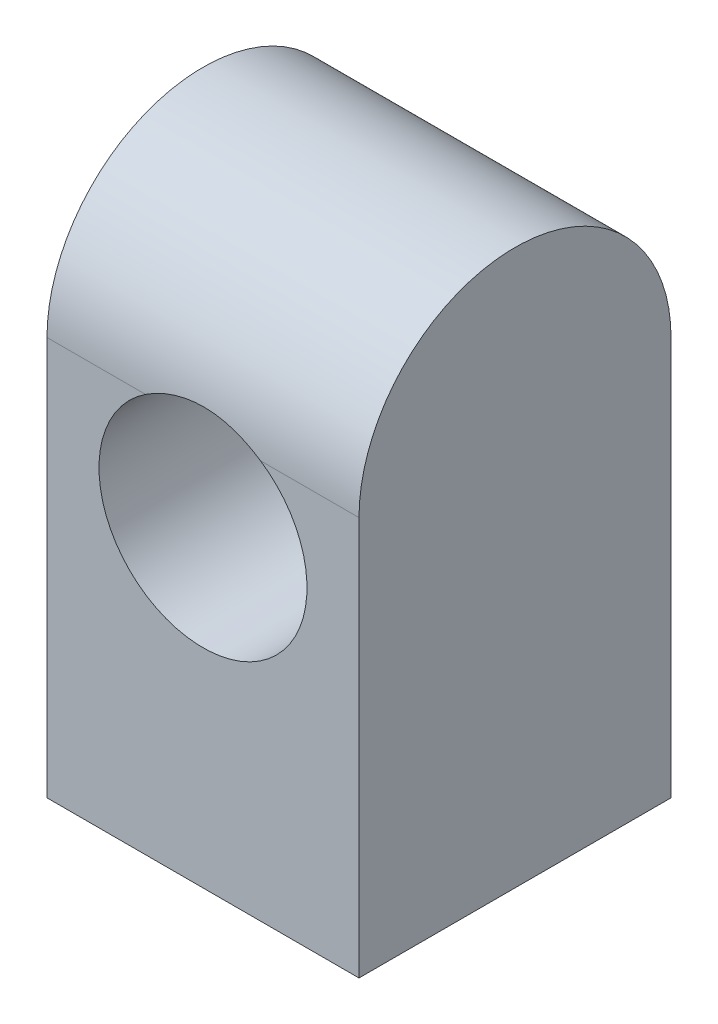
ISO-10303-21;
HEADER;
FILE_DESCRIPTION(('STEP AP214'),'2;1');
FILE_NAME('part.step','',(''),(''),'','','');
FILE_SCHEMA(('AUTOMOTIVE_DESIGN { 1 0 10303 214 1 1 1 1 }'));
ENDSEC;
DATA;
#1=APPLICATION_CONTEXT('core data for automotive mechanical design processes');
#2=APPLICATION_PROTOCOL_DEFINITION('international standard','automotive_design',2000,#1);
#3=PRODUCT_CONTEXT('',#1,'mechanical');
#4=PRODUCT('Part','Part','',(#3));
#5=PRODUCT_RELATED_PRODUCT_CATEGORY('part','',(#4));
#6=PRODUCT_DEFINITION_FORMATION('','',#4);
#7=PRODUCT_DEFINITION_CONTEXT('part definition',#1,'design');
#8=PRODUCT_DEFINITION('design','',#6,#7);
#9=PRODUCT_DEFINITION_SHAPE('','',#8);
#10=(LENGTH_UNIT() NAMED_UNIT(*) SI_UNIT(.MILLI.,.METRE.));
#11=(NAMED_UNIT(*) PLANE_ANGLE_UNIT() SI_UNIT($,.RADIAN.));
#12=(NAMED_UNIT(*) SI_UNIT($,.STERADIAN.) SOLID_ANGLE_UNIT());
#13=UNCERTAINTY_MEASURE_WITH_UNIT(LENGTH_MEASURE(1.E-05),#10,'distance_accuracy_value','');
#14=(GEOMETRIC_REPRESENTATION_CONTEXT(3) GLOBAL_UNCERTAINTY_ASSIGNED_CONTEXT((#13)) GLOBAL_UNIT_ASSIGNED_CONTEXT((#10,
#11,#12)) REPRESENTATION_CONTEXT('',''));
#15=CARTESIAN_POINT('',(0.,0.,0.));
#16=DIRECTION('',(0.,0.,1.));
#17=DIRECTION('',(1.,0.,0.));
#18=AXIS2_PLACEMENT_3D('',#15,#16,#17);
#19=CARTESIAN_POINT('',(18.,17.1398997695578,-8.));
#20=DIRECTION('',(0.,0.,1.));
#21=DIRECTION('',(0.,-1.,0.));
#22=AXIS2_PLACEMENT_3D('',#19,#20,#21);
#23=PLANE('',#22);
#24=DIRECTION('',(-1.,0.,0.));
#25=VECTOR('',#24,1.);
#26=CARTESIAN_POINT('',(18.,17.1398997695578,-8.));
#27=LINE('',#26,#25);
#28=CARTESIAN_POINT('',(5.6833752096446,17.1398997695578,-8.));
#29=VERTEX_POINT('',#28);
#30=CARTESIAN_POINT('',(0.,17.1398997695578,-8.));
#31=VERTEX_POINT('',#30);
#32=EDGE_CURVE('E192',#29,#31,#27,.T.);
#33=ORIENTED_EDGE('',*,*,#32,.F.);
#34=CARTESIAN_POINT('',(9.,12.1398997695578,-8.));
#35=DIRECTION('',(0.,0.,1.));
#36=DIRECTION('',(1.,0.,0.));
#37=AXIS2_PLACEMENT_3D('',#34,#35,#36);
#38=CIRCLE('',#37,6.);
#39=CARTESIAN_POINT('',(12.3166247903554,17.1398997695578,-8.));
#40=VERTEX_POINT('',#39);
#41=EDGE_CURVE('E51',#29,#40,#38,.T.);
#42=ORIENTED_EDGE('',*,*,#41,.T.);
#43=CARTESIAN_POINT('',(18.,17.1398997695578,-8.));
#44=VERTEX_POINT('',#43);
#45=EDGE_CURVE('E45',#44,#40,#27,.T.);
#46=ORIENTED_EDGE('',*,*,#45,.F.);
#47=DIRECTION('',(0.,1.,0.));
#48=VECTOR('',#47,1.);
#49=CARTESIAN_POINT('',(18.,17.1398997695578,-8.));
#50=LINE('',#49,#48);
#51=CARTESIAN_POINT('',(18.,-5.86010023044222,-8.));
#52=VERTEX_POINT('',#51);
#53=EDGE_CURVE('E212',#52,#44,#50,.T.);
#54=ORIENTED_EDGE('',*,*,#53,.F.);
#55=DIRECTION('',(-1.,0.,0.));
#56=VECTOR('',#55,1.);
#57=CARTESIAN_POINT('',(18.,-5.86010023044222,-8.));
#58=LINE('',#57,#56);
#59=CARTESIAN_POINT('',(0.,-5.86010023044222,-8.));
#60=VERTEX_POINT('',#59);
#61=EDGE_CURVE('E207',#52,#60,#58,.T.);
#62=ORIENTED_EDGE('',*,*,#61,.T.);
#63=DIRECTION('',(0.,1.,0.));
#64=VECTOR('',#63,1.);
#65=CARTESIAN_POINT('',(0.,17.1398997695578,-8.));
#66=LINE('',#65,#64);
#67=EDGE_CURVE('E197',#60,#31,#66,.T.);
#68=ORIENTED_EDGE('',*,*,#67,.T.);
#69=EDGE_LOOP('',(#33,#42,#46,#54,#62,#68));
#70=FACE_BOUND('',#69,.T.);
#71=ADVANCED_FACE('F38',(#70),#23,.F.);
#72=CARTESIAN_POINT('',(18.,17.1398997695578,1.));
#73=DIRECTION('',(-1.,0.,0.));
#74=DIRECTION('',(0.,0.,1.));
#75=AXIS2_PLACEMENT_3D('',#72,#73,#74);
#76=CYLINDRICAL_SURFACE('',#75,9.);
#77=ORIENTED_EDGE('',*,*,#45,.T.);
#78=CARTESIAN_POINT('',(12.3166247903554,17.1398997695578,-8.));
#79=CARTESIAN_POINT('',(12.1761745481952,17.2330854943156,-7.99998280686404));
#80=CARTESIAN_POINT('',(12.0317922057003,17.3203143442929,-7.99855170663781));
#81=CARTESIAN_POINT('',(11.7362436576243,17.4823062183514,-7.99385386357663));
#82=CARTESIAN_POINT('',(11.5850782346934,17.5570706759378,-7.99058733202013));
#83=CARTESIAN_POINT('',(11.2770934608133,17.6935668618835,-7.98321231082459));
#84=CARTESIAN_POINT('',(11.1202771782546,17.7553055419582,-7.97910427260756));
#85=CARTESIAN_POINT('',(10.8020081921265,17.8653792127511,-7.97088254766373));
#86=CARTESIAN_POINT('',(10.6405554727502,17.9137141577658,-7.96676886091772));
#87=CARTESIAN_POINT('',(10.3140870773853,17.9966523238767,-7.95922487573957));
#88=CARTESIAN_POINT('',(10.1490702362471,18.0312509805381,-7.9557948046545));
#89=CARTESIAN_POINT('',(9.8166910491816,18.0864445949821,-7.9501298620152));
#90=CARTESIAN_POINT('',(9.64932872217379,18.1070396656568,-7.94789498082582));
#91=CARTESIAN_POINT('',(9.31347345902791,18.1340730104191,-7.94493181592675));
#92=CARTESIAN_POINT('',(9.14498067854111,18.1405131949243,-7.94420332890699));
#93=CARTESIAN_POINT('',(8.80805607207803,18.1391944460575,-7.94435076543655));
#94=CARTESIAN_POINT('',(8.63962424450806,18.1314359155182,-7.94522664346831));
#95=CARTESIAN_POINT('',(8.30449927814603,18.101820240337,-7.94845959650483));
#96=CARTESIAN_POINT('',(8.13780257444923,18.0800029377208,-7.95081248523223));
#97=CARTESIAN_POINT('',(7.80683097987093,18.0224641842343,-7.95666871348));
#98=CARTESIAN_POINT('',(7.64255632608802,17.9867413813878,-7.9601721648598));
#99=CARTESIAN_POINT('',(7.3176976840931,17.9016732486215,-7.96780478435024));
#100=CARTESIAN_POINT('',(7.15711147776076,17.8523363511823,-7.97193356442458));
#101=CARTESIAN_POINT('',(6.8406941967366,17.7403956363477,-7.98011947678595));
#102=CARTESIAN_POINT('',(6.68486141124776,17.6777966581074,-7.98417663462359));
#103=CARTESIAN_POINT('',(6.38435800328011,17.5421783179672,-7.99125312525322));
#104=CARTESIAN_POINT('',(6.2394875580041,17.4696031409215,-7.99430395361245));
#105=CARTESIAN_POINT('',(5.95634049468018,17.3131287467241,-7.99866854537321));
#106=CARTESIAN_POINT('',(5.81805158792701,17.2292518520194,-7.99998567918921));
#107=CARTESIAN_POINT('',(5.6833752096446,17.1398997695578,-8.));
#108=B_SPLINE_CURVE_WITH_KNOTS('',3,(#78,#79,#80,#81,#82,#83,#84,#85,#86,#87,#88,#89,#90,#91,
#92,#93,#94,#95,#96,#97,#98,#99,#100,#101,#102,#103,#104,#105,#106,#107),.UNSPECIFIED.,.F.,.F.,
(4,2,2,2,2,2,2,2,2,2,2,2,2,2,4),(0.,0.505478352133197,1.01089853003349,1.5160482845355,
2.02119976144932,2.52651895507016,3.03183407494048,3.53708099064754,4.04231357217975,
4.54612060348861,5.04997663018365,5.55352126960014,6.05688248782416,6.54253134219247,
7.02723466241762),.UNSPECIFIED.);
#109=EDGE_CURVE('E150',#40,#29,#108,.T.);
#110=ORIENTED_EDGE('',*,*,#109,.T.);
#111=ORIENTED_EDGE('',*,*,#32,.T.);
#112=CARTESIAN_POINT('',(0.,17.1398997695578,1.));
#113=DIRECTION('',(1.,0.,0.));
#114=DIRECTION('',(0.,0.,1.));
#115=AXIS2_PLACEMENT_3D('',#112,#113,#114);
#116=CIRCLE('',#115,9.);
#117=CARTESIAN_POINT('',(0.,17.1398997695578,10.));
#118=VERTEX_POINT('',#117);
#119=EDGE_CURVE('E215',#31,#118,#116,.T.);
#120=ORIENTED_EDGE('',*,*,#119,.T.);
#121=DIRECTION('',(-1.,0.,0.));
#122=VECTOR('',#121,1.);
#123=CARTESIAN_POINT('',(18.,17.1398997695578,10.));
#124=LINE('',#123,#122);
#125=CARTESIAN_POINT('',(5.6833752096446,17.1398997695578,10.));
#126=VERTEX_POINT('',#125);
#127=EDGE_CURVE('E201',#126,#118,#124,.T.);
#128=ORIENTED_EDGE('',*,*,#127,.F.);
#129=CARTESIAN_POINT('',(5.6833752096446,17.1398997695578,10.));
#130=CARTESIAN_POINT('',(5.82382545180477,17.2330854943156,9.99998280686404));
#131=CARTESIAN_POINT('',(5.96820779429973,17.3203143442929,9.99855170663781));
#132=CARTESIAN_POINT('',(6.2637563423757,17.4823062183514,9.99385386357663));
#133=CARTESIAN_POINT('',(6.41492176530659,17.5570706759378,9.99058733202013));
#134=CARTESIAN_POINT('',(6.72290653918665,17.6935668618835,9.98321231082459));
#135=CARTESIAN_POINT('',(6.87972282174541,17.7553055419582,9.97910427260756));
#136=CARTESIAN_POINT('',(7.19799180787347,17.8653792127511,9.97088254766373));
#137=CARTESIAN_POINT('',(7.35944452724977,17.9137141577658,9.96676886091772));
#138=CARTESIAN_POINT('',(7.68591292261471,17.9966523238767,9.95922487573958));
#139=CARTESIAN_POINT('',(7.85092976375287,18.0312509805381,9.9557948046545));
#140=CARTESIAN_POINT('',(8.1833089508184,18.0864445949821,9.9501298620152));
#141=CARTESIAN_POINT('',(8.3506712778262,18.1070396656568,9.94789498082582));
#142=CARTESIAN_POINT('',(8.68652654097209,18.1340730104191,9.94493181592675));
#143=CARTESIAN_POINT('',(8.85501932145889,18.1405131949243,9.94420332890699));
#144=CARTESIAN_POINT('',(9.19194392792197,18.1391944460575,9.94435076543655));
#145=CARTESIAN_POINT('',(9.36037575549194,18.1314359155182,9.94522664346831));
#146=CARTESIAN_POINT('',(9.69550072185397,18.101820240337,9.94845959650483));
#147=CARTESIAN_POINT('',(9.86219742555077,18.0800029377208,9.95081248523224));
#148=CARTESIAN_POINT('',(10.1931690201291,18.0224641842343,9.95666871348));
#149=CARTESIAN_POINT('',(10.357443673912,17.9867413813878,9.9601721648598));
#150=CARTESIAN_POINT('',(10.6823023159069,17.9016732486215,9.96780478435024));
#151=CARTESIAN_POINT('',(10.8428885222392,17.8523363511823,9.97193356442458));
#152=CARTESIAN_POINT('',(11.1593058032634,17.7403956363477,9.98011947678595));
#153=CARTESIAN_POINT('',(11.3151385887522,17.6777966581074,9.98417663462359));
#154=CARTESIAN_POINT('',(11.6156419967199,17.5421783179672,9.99125312525322));
#155=CARTESIAN_POINT('',(11.7605124419959,17.4696031409215,9.99430395361245));
#156=CARTESIAN_POINT('',(12.0436595053198,17.3131287467241,9.99866854537321));
#157=CARTESIAN_POINT('',(12.181948412073,17.2292518520194,9.99998567918922));
#158=CARTESIAN_POINT('',(12.3166247903554,17.1398997695578,10.));
#159=B_SPLINE_CURVE_WITH_KNOTS('',3,(#129,#130,#131,#132,#133,#134,#135,#136,#137,#138,#139,
#140,#141,#142,#143,#144,#145,#146,#147,#148,#149,#150,#151,#152,#153,#154,#155,#156,#157,#158),
.UNSPECIFIED.,.F.,.F.,(4,2,2,2,2,2,2,2,2,2,2,2,2,2,4),(0.,0.505478352133197,1.01089853003348,
1.5160482845355,2.02119976144932,2.52651895507016,3.03183407494048,3.53708099064754,
4.04231357217975,4.54612060348861,5.04997663018365,5.55352126960013,6.05688248782416,
6.54253134219247,7.02723466241762),.UNSPECIFIED.);
#160=CARTESIAN_POINT('',(12.3166247903554,17.1398997695578,10.));
#161=VERTEX_POINT('',#160);
#162=EDGE_CURVE('E58',#126,#161,#159,.T.);
#163=ORIENTED_EDGE('',*,*,#162,.T.);
#164=CARTESIAN_POINT('',(18.,17.1398997695578,10.));
#165=VERTEX_POINT('',#164);
#166=EDGE_CURVE('E200',#165,#161,#124,.T.);
#167=ORIENTED_EDGE('',*,*,#166,.F.);
#168=CARTESIAN_POINT('',(18.,17.1398997695578,1.));
#169=DIRECTION('',(1.,0.,0.));
#170=DIRECTION('',(0.,0.,1.));
#171=AXIS2_PLACEMENT_3D('',#168,#169,#170);
#172=CIRCLE('',#171,9.);
#173=EDGE_CURVE('E221',#44,#165,#172,.T.);
#174=ORIENTED_EDGE('',*,*,#173,.F.);
#175=EDGE_LOOP('',(#77,#110,#111,#120,#128,#163,#167,#174));
#176=FACE_BOUND('',#175,.T.);
#177=ADVANCED_FACE('F156',(#176),#76,.T.);
#178=CARTESIAN_POINT('',(18.,17.1398997695578,10.));
#179=DIRECTION('',(0.,0.,-1.));
#180=DIRECTION('',(0.,1.,0.));
#181=AXIS2_PLACEMENT_3D('',#178,#179,#180);
#182=PLANE('',#181);
#183=ORIENTED_EDGE('',*,*,#166,.T.);
#184=CARTESIAN_POINT('',(9.,12.1398997695578,10.));
#185=DIRECTION('',(0.,0.,-1.));
#186=DIRECTION('',(0.,1.,0.));
#187=AXIS2_PLACEMENT_3D('',#184,#185,#186);
#188=CIRCLE('',#187,6.);
#189=EDGE_CURVE('E11',#161,#126,#188,.T.);
#190=ORIENTED_EDGE('',*,*,#189,.T.);
#191=ORIENTED_EDGE('',*,*,#127,.T.);
#192=DIRECTION('',(0.,-1.,0.));
#193=VECTOR('',#192,1.);
#194=CARTESIAN_POINT('',(0.,17.1398997695578,10.));
#195=LINE('',#194,#193);
#196=CARTESIAN_POINT('',(0.,-5.86010023044222,10.));
#197=VERTEX_POINT('',#196);
#198=EDGE_CURVE('E213',#118,#197,#195,.T.);
#199=ORIENTED_EDGE('',*,*,#198,.T.);
#200=DIRECTION('',(-1.,0.,0.));
#201=VECTOR('',#200,1.);
#202=CARTESIAN_POINT('',(18.,-5.86010023044222,10.));
#203=LINE('',#202,#201);
#204=CARTESIAN_POINT('',(18.,-5.86010023044222,10.));
#205=VERTEX_POINT('',#204);
#206=EDGE_CURVE('E204',#205,#197,#203,.T.);
#207=ORIENTED_EDGE('',*,*,#206,.F.);
#208=DIRECTION('',(0.,-1.,0.));
#209=VECTOR('',#208,1.);
#210=CARTESIAN_POINT('',(18.,17.1398997695578,10.));
#211=LINE('',#210,#209);
#212=EDGE_CURVE('E219',#165,#205,#211,.T.);
#213=ORIENTED_EDGE('',*,*,#212,.F.);
#214=EDGE_LOOP('',(#183,#190,#191,#199,#207,#213));
#215=FACE_BOUND('',#214,.T.);
#216=ADVANCED_FACE('F177',(#215),#182,.F.);
#217=CARTESIAN_POINT('',(18.,-5.86010023044222,10.));
#218=DIRECTION('',(0.,1.,0.));
#219=DIRECTION('',(0.,0.,1.));
#220=AXIS2_PLACEMENT_3D('',#217,#218,#219);
#221=PLANE('',#220);
#222=CARTESIAN_POINT('',(5.,-5.86010023044222,5.60107895721063));
#223=DIRECTION('',(0.,-1.,0.));
#224=DIRECTION('',(0.,0.,-1.));
#225=AXIS2_PLACEMENT_3D('',#222,#223,#224);
#226=CIRCLE('',#225,2.025);
#227=CARTESIAN_POINT('',(5.,-5.86010023044222,3.57607895721063));
#228=VERTEX_POINT('',#227);
#229=EDGE_CURVE('E116',#228,#228,#226,.T.);
#230=ORIENTED_EDGE('',*,*,#229,.F.);
#231=EDGE_LOOP('',(#230));
#232=FACE_BOUND('',#231,.T.);
#233=CARTESIAN_POINT('',(5.,-5.86010023044222,-2.39892104278937));
#234=DIRECTION('',(0.,-1.,0.));
#235=DIRECTION('',(0.,0.,-1.));
#236=AXIS2_PLACEMENT_3D('',#233,#234,#235);
#237=CIRCLE('',#236,2.025);
#238=CARTESIAN_POINT('',(5.,-5.86010023044222,-4.42392104278937));
#239=VERTEX_POINT('',#238);
#240=EDGE_CURVE('E109',#239,#239,#237,.T.);
#241=ORIENTED_EDGE('',*,*,#240,.F.);
#242=EDGE_LOOP('',(#241));
#243=FACE_BOUND('',#242,.T.);
#244=CARTESIAN_POINT('',(13.,-5.86010023044222,-2.39892104278937));
#245=DIRECTION('',(0.,-1.,0.));
#246=DIRECTION('',(0.,0.,-1.));
#247=AXIS2_PLACEMENT_3D('',#244,#245,#246);
#248=CIRCLE('',#247,2.025);
#249=CARTESIAN_POINT('',(13.,-5.86010023044222,-4.42392104278937));
#250=VERTEX_POINT('',#249);
#251=EDGE_CURVE('E125',#250,#250,#248,.T.);
#252=ORIENTED_EDGE('',*,*,#251,.F.);
#253=EDGE_LOOP('',(#252));
#254=FACE_BOUND('',#253,.T.);
#255=CARTESIAN_POINT('',(13.,-5.86010023044222,5.60107895721063));
#256=DIRECTION('',(0.,-1.,0.));
#257=DIRECTION('',(0.,0.,-1.));
#258=AXIS2_PLACEMENT_3D('',#255,#256,#257);
#259=CIRCLE('',#258,2.025);
#260=CARTESIAN_POINT('',(13.,-5.86010023044222,3.57607895721063));
#261=VERTEX_POINT('',#260);
#262=EDGE_CURVE('E134',#261,#261,#259,.T.);
#263=ORIENTED_EDGE('',*,*,#262,.F.);
#264=EDGE_LOOP('',(#263));
#265=FACE_BOUND('',#264,.T.);
#266=DIRECTION('',(0.,0.,-1.));
#267=VECTOR('',#266,1.);
#268=CARTESIAN_POINT('',(0.,-5.86010023044222,10.));
#269=LINE('',#268,#267);
#270=EDGE_CURVE('E210',#197,#60,#269,.T.);
#271=ORIENTED_EDGE('',*,*,#270,.T.);
#272=ORIENTED_EDGE('',*,*,#61,.F.);
#273=DIRECTION('',(0.,0.,-1.));
#274=VECTOR('',#273,1.);
#275=CARTESIAN_POINT('',(18.,-5.86010023044222,10.));
#276=LINE('',#275,#274);
#277=EDGE_CURVE('E209',#205,#52,#276,.T.);
#278=ORIENTED_EDGE('',*,*,#277,.F.);
#279=ORIENTED_EDGE('',*,*,#206,.T.);
#280=EDGE_LOOP('',(#271,#272,#278,#279));
#281=FACE_BOUND('',#280,.T.);
#282=ADVANCED_FACE('F171',(#232,#243,#254,#265,#281),#221,.F.);
#283=CARTESIAN_POINT('',(18.,17.1398997695578,1.));
#284=DIRECTION('',(-1.,0.,0.));
#285=DIRECTION('',(0.,0.,1.));
#286=AXIS2_PLACEMENT_3D('',#283,#284,#285);
#287=PLANE('',#286);
#288=ORIENTED_EDGE('',*,*,#53,.T.);
#289=ORIENTED_EDGE('',*,*,#173,.T.);
#290=ORIENTED_EDGE('',*,*,#212,.T.);
#291=ORIENTED_EDGE('',*,*,#277,.T.);
#292=EDGE_LOOP('',(#288,#289,#290,#291));
#293=FACE_BOUND('',#292,.T.);
#294=ADVANCED_FACE('F167',(#293),#287,.F.);
#295=CARTESIAN_POINT('',(0.,17.1398997695578,1.));
#296=DIRECTION('',(-1.,0.,0.));
#297=DIRECTION('',(0.,0.,1.));
#298=AXIS2_PLACEMENT_3D('',#295,#296,#297);
#299=PLANE('',#298);
#300=ORIENTED_EDGE('',*,*,#67,.F.);
#301=ORIENTED_EDGE('',*,*,#270,.F.);
#302=ORIENTED_EDGE('',*,*,#198,.F.);
#303=ORIENTED_EDGE('',*,*,#119,.F.);
#304=EDGE_LOOP('',(#300,#301,#302,#303));
#305=FACE_BOUND('',#304,.T.);
#306=ADVANCED_FACE('F165',(#305),#299,.T.);
#307=CARTESIAN_POINT('',(9.,12.1398997695578,-8.));
#308=DIRECTION('',(0.,0.,1.));
#309=DIRECTION('',(1.,0.,0.));
#310=AXIS2_PLACEMENT_3D('',#307,#308,#309);
#311=CYLINDRICAL_SURFACE('',#310,6.);
#312=ORIENTED_EDGE('',*,*,#189,.F.);
#313=ORIENTED_EDGE('',*,*,#162,.F.);
#314=EDGE_LOOP('',(#312,#313));
#315=FACE_BOUND('',#314,.T.);
#316=ORIENTED_EDGE('',*,*,#41,.F.);
#317=ORIENTED_EDGE('',*,*,#109,.F.);
#318=EDGE_LOOP('',(#316,#317));
#319=FACE_BOUND('',#318,.T.);
#320=ADVANCED_FACE('F159',(#315,#319),#311,.F.);
#321=CARTESIAN_POINT('',(13.,4.23989976955778,5.60107895721063));
#322=DIRECTION('',(0.,-1.,0.));
#323=DIRECTION('',(0.,0.,-1.));
#324=AXIS2_PLACEMENT_3D('',#321,#322,#323);
#325=CONICAL_SURFACE('',#324,1.64999999999999,1.02974425867665);
#326=CARTESIAN_POINT('',(13.,5.23131979095325,5.60107895721063));
#327=VERTEX_POINT('',#326);
#328=VERTEX_LOOP('',#327);
#329=FACE_BOUND('',#328,.T.);
#330=CARTESIAN_POINT('',(13.,4.23989976955778,5.60107895721063));
#331=DIRECTION('',(0.,-1.,0.));
#332=DIRECTION('',(0.,0.,-1.));
#333=AXIS2_PLACEMENT_3D('',#330,#331,#332);
#334=CIRCLE('',#333,1.64999999999999);
#335=CARTESIAN_POINT('',(13.,4.23989976955778,3.95107895721064));
#336=VERTEX_POINT('',#335);
#337=EDGE_CURVE('E140',#336,#336,#334,.T.);
#338=ORIENTED_EDGE('',*,*,#337,.T.);
#339=EDGE_LOOP('',(#338));
#340=FACE_BOUND('',#339,.T.);
#341=ADVANCED_FACE('F164',(#329,#340),#325,.F.);
#342=CARTESIAN_POINT('',(13.,-5.86010023044222,5.60107895721063));
#343=DIRECTION('',(0.,-1.,0.));
#344=DIRECTION('',(0.,0.,-1.));
#345=AXIS2_PLACEMENT_3D('',#342,#343,#344);
#346=CYLINDRICAL_SURFACE('',#345,1.64999999999999);
#347=ORIENTED_EDGE('',*,*,#337,.F.);
#348=EDGE_LOOP('',(#347));
#349=FACE_BOUND('',#348,.T.);
#350=CARTESIAN_POINT('',(13.,-5.48510023044222,5.60107895721063));
#351=DIRECTION('',(0.,-1.,0.));
#352=DIRECTION('',(0.,0.,-1.));
#353=AXIS2_PLACEMENT_3D('',#350,#351,#352);
#354=CIRCLE('',#353,1.64999999999999);
#355=CARTESIAN_POINT('',(13.,-5.48510023044222,3.95107895721064));
#356=VERTEX_POINT('',#355);
#357=EDGE_CURVE('E137',#356,#356,#354,.T.);
#358=ORIENTED_EDGE('',*,*,#357,.T.);
#359=EDGE_LOOP('',(#358));
#360=FACE_BOUND('',#359,.T.);
#361=ADVANCED_FACE('F269',(#349,#360),#346,.F.);
#362=CARTESIAN_POINT('',(13.,-5.86010023044222,5.60107895721063));
#363=DIRECTION('',(0.,-1.,0.));
#364=DIRECTION('',(0.,0.,-1.));
#365=AXIS2_PLACEMENT_3D('',#362,#363,#364);
#366=CONICAL_SURFACE('',#365,2.025,0.785398163397458);
#367=ORIENTED_EDGE('',*,*,#357,.F.);
#368=EDGE_LOOP('',(#367));
#369=FACE_BOUND('',#368,.T.);
#370=ORIENTED_EDGE('',*,*,#262,.T.);
#371=EDGE_LOOP('',(#370));
#372=FACE_BOUND('',#371,.T.);
#373=ADVANCED_FACE('F279',(#369,#372),#366,.F.);
#374=CARTESIAN_POINT('',(13.,4.23989976955778,-2.39892104278937));
#375=DIRECTION('',(0.,-1.,0.));
#376=DIRECTION('',(0.,0.,-1.));
#377=AXIS2_PLACEMENT_3D('',#374,#375,#376);
#378=CONICAL_SURFACE('',#377,1.64999999999999,1.02974425867665);
#379=CARTESIAN_POINT('',(13.,5.23131979095325,-2.39892104278937));
#380=VERTEX_POINT('',#379);
#381=VERTEX_LOOP('',#380);
#382=FACE_BOUND('',#381,.T.);
#383=CARTESIAN_POINT('',(13.,4.23989976955778,-2.39892104278937));
#384=DIRECTION('',(0.,-1.,0.));
#385=DIRECTION('',(0.,0.,-1.));
#386=AXIS2_PLACEMENT_3D('',#383,#384,#385);
#387=CIRCLE('',#386,1.64999999999999);
#388=CARTESIAN_POINT('',(13.,4.23989976955778,-4.04892104278936));
#389=VERTEX_POINT('',#388);
#390=EDGE_CURVE('E131',#389,#389,#387,.T.);
#391=ORIENTED_EDGE('',*,*,#390,.T.);
#392=EDGE_LOOP('',(#391));
#393=FACE_BOUND('',#392,.T.);
#394=ADVANCED_FACE('F290',(#382,#393),#378,.F.);
#395=CARTESIAN_POINT('',(13.,-5.86010023044222,-2.39892104278937));
#396=DIRECTION('',(0.,-1.,0.));
#397=DIRECTION('',(0.,0.,-1.));
#398=AXIS2_PLACEMENT_3D('',#395,#396,#397);
#399=CYLINDRICAL_SURFACE('',#398,1.64999999999999);
#400=ORIENTED_EDGE('',*,*,#390,.F.);
#401=EDGE_LOOP('',(#400));
#402=FACE_BOUND('',#401,.T.);
#403=CARTESIAN_POINT('',(13.,-5.48510023044222,-2.39892104278937));
#404=DIRECTION('',(0.,-1.,0.));
#405=DIRECTION('',(0.,0.,-1.));
#406=AXIS2_PLACEMENT_3D('',#403,#404,#405);
#407=CIRCLE('',#406,1.64999999999999);
#408=CARTESIAN_POINT('',(13.,-5.48510023044222,-4.04892104278936));
#409=VERTEX_POINT('',#408);
#410=EDGE_CURVE('E128',#409,#409,#407,.T.);
#411=ORIENTED_EDGE('',*,*,#410,.T.);
#412=EDGE_LOOP('',(#411));
#413=FACE_BOUND('',#412,.T.);
#414=ADVANCED_FACE('F300',(#402,#413),#399,.F.);
#415=CARTESIAN_POINT('',(13.,-5.86010023044222,-2.39892104278937));
#416=DIRECTION('',(0.,-1.,0.));
#417=DIRECTION('',(0.,0.,-1.));
#418=AXIS2_PLACEMENT_3D('',#415,#416,#417);
#419=CONICAL_SURFACE('',#418,2.025,0.785398163397458);
#420=ORIENTED_EDGE('',*,*,#410,.F.);
#421=EDGE_LOOP('',(#420));
#422=FACE_BOUND('',#421,.T.);
#423=ORIENTED_EDGE('',*,*,#251,.T.);
#424=EDGE_LOOP('',(#423));
#425=FACE_BOUND('',#424,.T.);
#426=ADVANCED_FACE('F310',(#422,#425),#419,.F.);
#427=CARTESIAN_POINT('',(5.,4.23989976955778,-2.39892104278937));
#428=DIRECTION('',(0.,-1.,0.));
#429=DIRECTION('',(0.,0.,-1.));
#430=AXIS2_PLACEMENT_3D('',#427,#428,#429);
#431=CONICAL_SURFACE('',#430,1.64999999999999,1.02974425867665);
#432=CARTESIAN_POINT('',(5.,5.23131979095325,-2.39892104278937));
#433=VERTEX_POINT('',#432);
#434=VERTEX_LOOP('',#433);
#435=FACE_BOUND('',#434,.T.);
#436=CARTESIAN_POINT('',(5.,4.23989976955778,-2.39892104278937));
#437=DIRECTION('',(0.,-1.,0.));
#438=DIRECTION('',(0.,0.,-1.));
#439=AXIS2_PLACEMENT_3D('',#436,#437,#438);
#440=CIRCLE('',#439,1.64999999999999);
#441=CARTESIAN_POINT('',(5.,4.23989976955778,-4.04892104278936));
#442=VERTEX_POINT('',#441);
#443=EDGE_CURVE('E122',#442,#442,#440,.T.);
#444=ORIENTED_EDGE('',*,*,#443,.T.);
#445=EDGE_LOOP('',(#444));
#446=FACE_BOUND('',#445,.T.);
#447=ADVANCED_FACE('F322',(#435,#446),#431,.F.);
#448=CARTESIAN_POINT('',(5.,-5.86010023044222,-2.39892104278937));
#449=DIRECTION('',(0.,-1.,0.));
#450=DIRECTION('',(0.,0.,-1.));
#451=AXIS2_PLACEMENT_3D('',#448,#449,#450);
#452=CYLINDRICAL_SURFACE('',#451,1.64999999999999);
#453=ORIENTED_EDGE('',*,*,#443,.F.);
#454=EDGE_LOOP('',(#453));
#455=FACE_BOUND('',#454,.T.);
#456=CARTESIAN_POINT('',(5.,-5.48510023044222,-2.39892104278937));
#457=DIRECTION('',(0.,-1.,0.));
#458=DIRECTION('',(0.,0.,-1.));
#459=AXIS2_PLACEMENT_3D('',#456,#457,#458);
#460=CIRCLE('',#459,1.64999999999999);
#461=CARTESIAN_POINT('',(5.,-5.48510023044222,-4.04892104278936));
#462=VERTEX_POINT('',#461);
#463=EDGE_CURVE('E113',#462,#462,#460,.T.);
#464=ORIENTED_EDGE('',*,*,#463,.T.);
#465=EDGE_LOOP('',(#464));
#466=FACE_BOUND('',#465,.T.);
#467=ADVANCED_FACE('F332',(#455,#466),#452,.F.);
#468=CARTESIAN_POINT('',(5.,-5.86010023044222,-2.39892104278937));
#469=DIRECTION('',(0.,-1.,0.));
#470=DIRECTION('',(0.,0.,-1.));
#471=AXIS2_PLACEMENT_3D('',#468,#469,#470);
#472=CONICAL_SURFACE('',#471,2.025,0.785398163397458);
#473=ORIENTED_EDGE('',*,*,#463,.F.);
#474=EDGE_LOOP('',(#473));
#475=FACE_BOUND('',#474,.T.);
#476=ORIENTED_EDGE('',*,*,#240,.T.);
#477=EDGE_LOOP('',(#476));
#478=FACE_BOUND('',#477,.T.);
#479=ADVANCED_FACE('F103',(#475,#478),#472,.F.);
#480=CARTESIAN_POINT('',(5.,4.23989976955778,5.60107895721063));
#481=DIRECTION('',(0.,-1.,0.));
#482=DIRECTION('',(0.,0.,-1.));
#483=AXIS2_PLACEMENT_3D('',#480,#481,#482);
#484=CONICAL_SURFACE('',#483,1.64999999999999,1.02974425867665);
#485=CARTESIAN_POINT('',(5.,5.23131979095325,5.60107895721063));
#486=VERTEX_POINT('',#485);
#487=VERTEX_LOOP('',#486);
#488=FACE_BOUND('',#487,.T.);
#489=CARTESIAN_POINT('',(5.,4.23989976955778,5.60107895721063));
#490=DIRECTION('',(0.,-1.,0.));
#491=DIRECTION('',(0.,0.,-1.));
#492=AXIS2_PLACEMENT_3D('',#489,#490,#491);
#493=CIRCLE('',#492,1.64999999999999);
#494=CARTESIAN_POINT('',(5.,4.23989976955778,3.95107895721064));
#495=VERTEX_POINT('',#494);
#496=EDGE_CURVE('E107',#495,#495,#493,.T.);
#497=ORIENTED_EDGE('',*,*,#496,.T.);
#498=EDGE_LOOP('',(#497));
#499=FACE_BOUND('',#498,.T.);
#500=ADVANCED_FACE('F99',(#488,#499),#484,.F.);
#501=CARTESIAN_POINT('',(5.,-5.86010023044222,5.60107895721063));
#502=DIRECTION('',(0.,-1.,0.));
#503=DIRECTION('',(0.,0.,-1.));
#504=AXIS2_PLACEMENT_3D('',#501,#502,#503);
#505=CYLINDRICAL_SURFACE('',#504,1.64999999999999);
#506=ORIENTED_EDGE('',*,*,#496,.F.);
#507=EDGE_LOOP('',(#506));
#508=FACE_BOUND('',#507,.T.);
#509=CARTESIAN_POINT('',(5.,-5.48510023044222,5.60107895721063));
#510=DIRECTION('',(0.,-1.,0.));
#511=DIRECTION('',(0.,0.,-1.));
#512=AXIS2_PLACEMENT_3D('',#509,#510,#511);
#513=CIRCLE('',#512,1.64999999999999);
#514=CARTESIAN_POINT('',(5.,-5.48510023044222,3.95107895721064));
#515=VERTEX_POINT('',#514);
#516=EDGE_CURVE('E110',#515,#515,#513,.T.);
#517=ORIENTED_EDGE('',*,*,#516,.T.);
#518=EDGE_LOOP('',(#517));
#519=FACE_BOUND('',#518,.T.);
#520=ADVANCED_FACE('F102',(#508,#519),#505,.F.);
#521=CARTESIAN_POINT('',(5.,-5.86010023044222,5.60107895721063));
#522=DIRECTION('',(0.,-1.,0.));
#523=DIRECTION('',(0.,0.,-1.));
#524=AXIS2_PLACEMENT_3D('',#521,#522,#523);
#525=CONICAL_SURFACE('',#524,2.025,0.785398163397458);
#526=ORIENTED_EDGE('',*,*,#516,.F.);
#527=EDGE_LOOP('',(#526));
#528=FACE_BOUND('',#527,.T.);
#529=ORIENTED_EDGE('',*,*,#229,.T.);
#530=EDGE_LOOP('',(#529));
#531=FACE_BOUND('',#530,.T.);
#532=ADVANCED_FACE('F370',(#528,#531),#525,.F.);
#533=CLOSED_SHELL('',(#71,#177,#216,#282,#294,#306,#320,#341,#361,#373,#394,#414,#426,#447,#467,
#479,#500,#520,#532));
#534=MANIFOLD_SOLID_BREP('B2',#533);
#535=ADVANCED_BREP_SHAPE_REPRESENTATION('',(#18,#534),#14);
#536=SHAPE_DEFINITION_REPRESENTATION(#9,#535);
ENDSEC;
END-ISO-10303-21;
